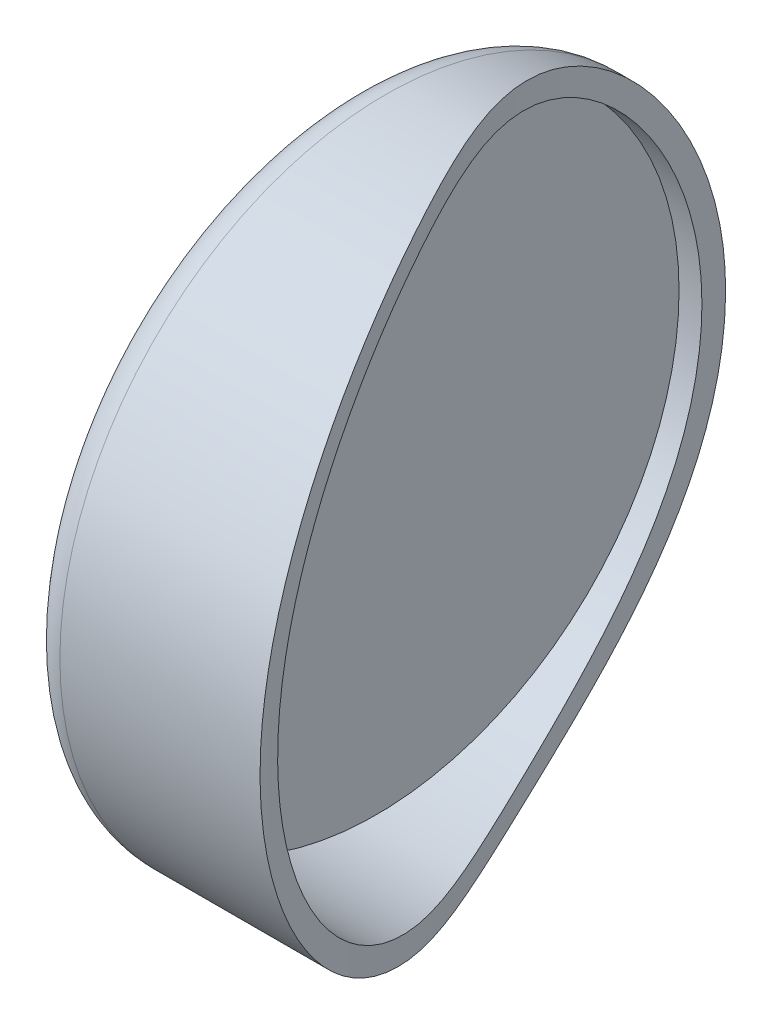
ISO-10303-21;
HEADER;
FILE_DESCRIPTION(('STEP AP214'),'2;1');
FILE_NAME('part.step','',(''),(''),'','','');
FILE_SCHEMA(('AUTOMOTIVE_DESIGN { 1 0 10303 214 1 1 1 1 }'));
ENDSEC;
DATA;
#1=APPLICATION_CONTEXT('core data for automotive mechanical design processes');
#2=APPLICATION_PROTOCOL_DEFINITION('international standard','automotive_design',2000,#1);
#3=PRODUCT_CONTEXT('',#1,'mechanical');
#4=PRODUCT('Part','Part','',(#3));
#5=PRODUCT_RELATED_PRODUCT_CATEGORY('part','',(#4));
#6=PRODUCT_DEFINITION_FORMATION('','',#4);
#7=PRODUCT_DEFINITION_CONTEXT('part definition',#1,'design');
#8=PRODUCT_DEFINITION('design','',#6,#7);
#9=PRODUCT_DEFINITION_SHAPE('','',#8);
#10=(LENGTH_UNIT() NAMED_UNIT(*) SI_UNIT(.MILLI.,.METRE.));
#11=(NAMED_UNIT(*) PLANE_ANGLE_UNIT() SI_UNIT($,.RADIAN.));
#12=(NAMED_UNIT(*) SI_UNIT($,.STERADIAN.) SOLID_ANGLE_UNIT());
#13=UNCERTAINTY_MEASURE_WITH_UNIT(LENGTH_MEASURE(1.E-05),#10,'distance_accuracy_value','');
#14=(GEOMETRIC_REPRESENTATION_CONTEXT(3) GLOBAL_UNCERTAINTY_ASSIGNED_CONTEXT((#13)) GLOBAL_UNIT_ASSIGNED_CONTEXT((#10,
#11,#12)) REPRESENTATION_CONTEXT('',''));
#15=CARTESIAN_POINT('',(0.,0.,0.));
#16=DIRECTION('',(0.,0.,1.));
#17=DIRECTION('',(1.,0.,0.));
#18=AXIS2_PLACEMENT_3D('',#15,#16,#17);
#19=CARTESIAN_POINT('',(50.,0.,0.));
#20=DIRECTION('',(-1.,0.,0.));
#21=DIRECTION('',(0.,0.,1.));
#22=AXIS2_PLACEMENT_3D('',#19,#20,#21);
#23=CYLINDRICAL_SURFACE('',#22,70.);
#24=CARTESIAN_POINT('',(7.,0.,0.));
#25=DIRECTION('',(1.,0.,0.));
#26=DIRECTION('',(0.,0.,-1.));
#27=AXIS2_PLACEMENT_3D('',#24,#25,#26);
#28=CIRCLE('',#27,70.);
#29=CARTESIAN_POINT('',(7.,0.,-70.));
#30=VERTEX_POINT('',#29);
#31=EDGE_CURVE('E52',#30,#30,#28,.T.);
#32=ORIENTED_EDGE('',*,*,#31,.T.);
#33=EDGE_LOOP('',(#32));
#34=FACE_BOUND('',#33,.T.);
#35=CARTESIAN_POINT('',(50.,0.,70.));
#36=CARTESIAN_POINT('',(50.0000018003316,1.91130000398539,69.9999962525769));
#37=CARTESIAN_POINT('',(49.9823059619208,3.82266490187084,69.9216631907981));
#38=CARTESIAN_POINT('',(49.9107786034703,7.63195740908031,69.6089486036693));
#39=CARTESIAN_POINT('',(49.8569455766294,9.52988445475555,69.3745605713471));
#40=CARTESIAN_POINT('',(49.7110853451611,13.298961887616,68.7516272956741));
#41=CARTESIAN_POINT('',(49.6190550008448,15.1701100605876,68.3630693802023));
#42=CARTESIAN_POINT('',(49.3939428916241,18.8720619893456,67.4350547678297));
#43=CARTESIAN_POINT('',(49.2608617481148,20.7028663553758,66.8956003550947));
#44=CARTESIAN_POINT('',(48.9505515883576,24.3113521581381,65.6703082779987));
#45=CARTESIAN_POINT('',(48.7733145159935,26.0890238346137,64.9844439048544));
#46=CARTESIAN_POINT('',(48.3719560001871,29.5781725991728,63.4724097122345));
#47=CARTESIAN_POINT('',(48.1478345356526,31.2896496574761,62.6462398296384));
#48=CARTESIAN_POINT('',(47.6506613438221,34.6341848102122,60.86103950687));
#49=CARTESIAN_POINT('',(47.3776144183036,36.2672505803761,59.9020221070789));
#50=CARTESIAN_POINT('',(46.7813553529707,39.4439895004782,57.8596360224635));
#51=CARTESIAN_POINT('',(46.4581432229093,40.9876626677959,56.7762673618155));
#52=CARTESIAN_POINT('',(45.7618353126724,43.9728757710367,54.4968512209325));
#53=CARTESIAN_POINT('',(45.3888303684963,45.4145945419111,53.3010100686265));
#54=CARTESIAN_POINT('',(44.5929291213869,48.190206523011,50.8053836716068));
#55=CARTESIAN_POINT('',(44.1700329584453,49.5241000357696,49.5055987185563));
#56=CARTESIAN_POINT('',(43.2753925222116,52.0767967651697,46.812923744282));
#57=CARTESIAN_POINT('',(42.8036417238308,53.2955845664718,45.4200212949936));
#58=CARTESIAN_POINT('',(41.8128483553499,55.6119088401151,42.5524623568207));
#59=CARTESIAN_POINT('',(41.2938048433208,56.7094428964819,41.0778042398379));
#60=CARTESIAN_POINT('',(40.3794236056434,58.4556011825207,38.5295906756666));
#61=CARTESIAN_POINT('',(39.995984212328,59.1374837269307,37.4743593249841));
#62=CARTESIAN_POINT('',(39.2082563656509,60.4404359608465,35.3344390659105));
#63=CARTESIAN_POINT('',(38.803967418465,61.0615042089472,34.2497494600854));
#64=CARTESIAN_POINT('',(37.9752201629652,62.2418240149578,32.0547696084488));
#65=CARTESIAN_POINT('',(37.5507617294224,62.8010751889844,30.9444792037084));
#66=CARTESIAN_POINT('',(36.6823773872359,63.8569983359353,28.7022508909051));
#67=CARTESIAN_POINT('',(36.2384546631374,64.3536804946315,27.5703165409622));
#68=CARTESIAN_POINT('',(35.3316242416914,65.2841450392752,25.2883080234928));
#69=CARTESIAN_POINT('',(34.8687168042539,65.7179282859708,24.1382341044382));
#70=CARTESIAN_POINT('',(34.1605388654334,66.3212257353159,22.402464514663));
#71=CARTESIAN_POINT('',(33.9221682900473,66.51443449884,21.8220779847266));
#72=CARTESIAN_POINT('',(33.4408441507808,66.8850746069647,20.6581641324341));
#73=CARTESIAN_POINT('',(33.1978906495045,67.062506166897,20.0746368530592));
#74=CARTESIAN_POINT('',(32.7567089219999,67.3675392623906,19.0223941749003));
#75=CARTESIAN_POINT('',(32.5592985218957,67.4979914500122,18.5541586718265));
#76=CARTESIAN_POINT('',(32.1615756327022,67.7488307492125,17.6162309447409));
#77=CARTESIAN_POINT('',(31.9612631764652,67.8692179746267,17.1465387372667));
#78=CARTESIAN_POINT('',(31.5579662400618,68.099971499391,16.2058152093342));
#79=CARTESIAN_POINT('',(31.3549816403137,68.2103373485156,15.734783829691));
#80=CARTESIAN_POINT('',(30.946662312012,68.4210833977731,14.7915140927725));
#81=CARTESIAN_POINT('',(30.7413275750215,68.5214635620455,14.319275731169));
#82=CARTESIAN_POINT('',(30.122232236501,68.8076974343487,12.9008318853234));
#83=CARTESIAN_POINT('',(29.7053893942726,68.9786394560444,11.9529183148476));
#84=CARTESIAN_POINT('',(28.8662186125377,69.2810006459276,10.0532607918036));
#85=CARTESIAN_POINT('',(28.4438906404444,69.4124195791994,9.10151681650242));
#86=CARTESIAN_POINT('',(27.595858839554,69.6361051990004,7.19289203604649));
#87=CARTESIAN_POINT('',(27.1701503602873,69.7283022098274,6.23600512200615));
#88=CARTESIAN_POINT('',(26.3191547951072,69.8732344656959,4.31913380809848));
#89=CARTESIAN_POINT('',(25.8938676849327,69.9259721325379,3.35914960195867));
#90=CARTESIAN_POINT('',(25.0467884748518,69.991875964692,1.43624233619641));
#91=CARTESIAN_POINT('',(24.6249964783283,70.0050409636096,0.47331919078682));
#92=CARTESIAN_POINT('',(23.7879949621204,69.9915150958389,-1.4553026518381));
#93=CARTESIAN_POINT('',(23.3727865723823,69.9648174607671,-2.42100179260845));
#94=CARTESIAN_POINT('',(22.5085018262151,69.8661450251981,-4.45740766110544));
#95=CARTESIAN_POINT('',(22.0605171785261,69.7896588296474,-5.52836432245546));
#96=CARTESIAN_POINT('',(21.1805109326669,69.5866117243761,-7.67221166687009));
#97=CARTESIAN_POINT('',(20.7484906137398,69.4600468112537,-8.7451024977289));
#98=CARTESIAN_POINT('',(19.9042218988581,69.1559939890128,-10.8914255270733));
#99=CARTESIAN_POINT('',(19.4919725657759,68.9785084962758,-11.964857697458));
#100=CARTESIAN_POINT('',(18.6905294533441,68.5717310470367,-14.1106404103873));
#101=CARTESIAN_POINT('',(18.3013373608329,68.3424353060558,-15.1829908681679));
#102=CARTESIAN_POINT('',(17.5498597092219,67.8319653328452,-17.3213568419703));
#103=CARTESIAN_POINT('',(17.1875038101539,67.5509339785347,-18.3873816560336));
#104=CARTESIAN_POINT('',(16.4906433722979,66.9359760726796,-20.5134027174912));
#105=CARTESIAN_POINT('',(16.1561413566166,66.6020447371957,-21.5733984106603));
#106=CARTESIAN_POINT('',(15.5165191133858,65.8810422115986,-23.6839951573259));
#107=CARTESIAN_POINT('',(15.2113949025932,65.4939782428823,-24.734597466869));
#108=CARTESIAN_POINT('',(14.6312785639093,64.6667924266737,-26.8228828704973));
#109=CARTESIAN_POINT('',(14.3562801854709,64.2266816253588,-27.8605686047764));
#110=CARTESIAN_POINT('',(13.8010099571301,63.2301833421241,-30.0598177833477));
#111=CARTESIAN_POINT('',(13.5251135270588,62.6661228327089,-31.2190213390867));
#112=CARTESIAN_POINT('',(13.011326826359,61.4710446598636,-33.5109071863992));
#113=CARTESIAN_POINT('',(12.7734340457399,60.8400314229811,-34.6435912252615));
#114=CARTESIAN_POINT('',(12.333854117487,59.5126784688247,-36.8772114946731));
#115=CARTESIAN_POINT('',(12.1321658208053,58.8163408258673,-37.9781487318627));
#116=CARTESIAN_POINT('',(11.7623832390699,57.3598177610642,-40.1441923584439));
#117=CARTESIAN_POINT('',(11.5943182763706,56.5995774240628,-41.2092668051838));
#118=CARTESIAN_POINT('',(11.2890779783303,55.018248739185,-43.2978978767897));
#119=CARTESIAN_POINT('',(11.1519033205706,54.1971590570984,-44.3214535905354));
#120=CARTESIAN_POINT('',(10.9052640321049,52.4970736852052,-46.3225793045326));
#121=CARTESIAN_POINT('',(10.7957978854337,51.6180811666486,-47.3001518181957));
#122=CARTESIAN_POINT('',(10.5638150743501,49.4563423753804,-49.5720104752358));
#123=CARTESIAN_POINT('',(10.4524672424479,48.1483157113886,-50.8435285410729));
#124=CARTESIAN_POINT('',(10.2677596510069,45.435716050429,-53.2815356800938));
#125=CARTESIAN_POINT('',(10.1943970516486,44.031150279731,-54.4480325993907));
#126=CARTESIAN_POINT('',(10.0773330183528,41.1347612746575,-56.6679766408525));
#127=CARTESIAN_POINT('',(10.0336239765413,39.6429605279277,-57.7214527010509));
#128=CARTESIAN_POINT('',(9.96826236017668,36.5812333208901,-59.7088341594736));
#129=CARTESIAN_POINT('',(9.94661092548707,35.0113028274945,-60.6427333761859));
#130=CARTESIAN_POINT('',(9.91789279828104,31.7153076487677,-62.432728815322));
#131=CARTESIAN_POINT('',(9.91168899033256,29.9854000882016,-63.2817715472802));
#132=CARTESIAN_POINT('',(9.90963057033029,26.4614692253321,-64.8343903711833));
#133=CARTESIAN_POINT('',(9.91377625696378,24.6674440740624,-65.5379622641929));
#134=CARTESIAN_POINT('',(9.92690900767121,21.0271909461663,-66.7949525017638));
#135=CARTESIAN_POINT('',(9.9358969405273,19.1809536581247,-67.3483438745592));
#136=CARTESIAN_POINT('',(9.95442410362848,15.4491474555595,-68.3010427693062));
#137=CARTESIAN_POINT('',(9.9639633366546,13.5635783426586,-68.700349513905));
#138=CARTESIAN_POINT('',(9.98069434019879,9.72605989045413,-69.3488966953937));
#139=CARTESIAN_POINT('',(9.98783266929288,7.77354781380426,-69.5948134151373));
#140=CARTESIAN_POINT('',(9.99751835051571,3.8547012137418,-69.9214359056832));
#141=CARTESIAN_POINT('',(10.0000656266398,1.88836646203667,-70.0021389413863));
#142=CARTESIAN_POINT('',(9.99993169721231,-2.04406650629275,-69.9977744782511));
#143=CARTESIAN_POINT('',(9.99725045001398,-4.01016472090822,-69.9127056589933));
#144=CARTESIAN_POINT('',(9.98732402555103,-7.92846657601206,-69.5773265396055));
#145=CARTESIAN_POINT('',(9.98007886408241,-9.88067026456663,-69.3270168113848));
#146=CARTESIAN_POINT('',(9.96731124831394,-12.7879971193687,-68.8290335349409));
#147=CARTESIAN_POINT('',(9.96273656611362,-13.7539839048279,-68.6425222345954));
#148=CARTESIAN_POINT('',(9.95334461017676,-15.6772152950928,-68.2289668116408));
#149=CARTESIAN_POINT('',(9.94852735912667,-16.6344607075866,-68.0019264745069));
#150=CARTESIAN_POINT('',(9.93910173505499,-18.5386086016579,-67.5076864516678));
#151=CARTESIAN_POINT('',(9.9344933822661,-19.4855100746676,-67.240482886752));
#152=CARTESIAN_POINT('',(9.92602756218746,-21.3671303601561,-66.6664316827342));
#153=CARTESIAN_POINT('',(9.92217002457231,-22.3018503059629,-66.3595877610451));
#154=CARTESIAN_POINT('',(9.91582738289556,-24.1577060829675,-65.7067199036378));
#155=CARTESIAN_POINT('',(9.91334253589435,-25.0788393384055,-65.3606886440135));
#156=CARTESIAN_POINT('',(9.91045318599057,-26.9056199120294,-64.6301417881728));
#157=CARTESIAN_POINT('',(9.91004848704367,-27.8112686815381,-64.2456298220675));
#158=CARTESIAN_POINT('',(9.9121083648527,-29.6056405703085,-63.4387409206909));
#159=CARTESIAN_POINT('',(9.91457321785877,-30.4943620516179,-63.0163603434433));
#160=CARTESIAN_POINT('',(9.92324431748104,-32.2531149258016,-62.1345650745391));
#161=CARTESIAN_POINT('',(9.92945020744462,-33.1231480921431,-61.6751539168176));
#162=CARTESIAN_POINT('',(9.94655729286336,-34.8431509957535,-60.7200346663467));
#163=CARTESIAN_POINT('',(9.95745906068776,-35.6931182739139,-60.2243221550278));
#164=CARTESIAN_POINT('',(9.98498969290842,-37.3712576458986,-59.1976061975909));
#165=CARTESIAN_POINT('',(10.0016180017531,-38.1994318455588,-58.6666061788674));
#166=CARTESIAN_POINT('',(10.0417133348979,-39.8326448286116,-57.5701995666731));
#167=CARTESIAN_POINT('',(10.0651810927974,-40.6376811200508,-57.0047892875077));
#168=CARTESIAN_POINT('',(10.120133531042,-42.2229606282549,-55.8407425206644));
#169=CARTESIAN_POINT('',(10.1516174150298,-43.003206299174,-55.2421093381136));
#170=CARTESIAN_POINT('',(10.2238533783861,-44.5376024616365,-54.0126699692889));
#171=CARTESIAN_POINT('',(10.2646062994534,-45.2917505761537,-53.3818608652352));
#172=CARTESIAN_POINT('',(10.3566773588878,-46.7723778991138,-52.0894444651618));
#173=CARTESIAN_POINT('',(10.4079944302186,-47.4988598932092,-51.4278402848302));
#174=CARTESIAN_POINT('',(10.5225481870651,-48.9229050475497,-50.0750820657441));
#175=CARTESIAN_POINT('',(10.585785708671,-49.6204661751205,-49.383925956873));
#176=CARTESIAN_POINT('',(10.7255442842335,-50.9852059708672,-47.9736558333663));
#177=CARTESIAN_POINT('',(10.8020643537504,-51.6523868860583,-47.2545438937479));
#178=CARTESIAN_POINT('',(10.9954453810907,-53.1545361657706,-45.5657052763155));
#179=CARTESIAN_POINT('',(11.1174855679789,-53.9783735020094,-44.5866267002481));
#180=CARTESIAN_POINT('',(11.3896072386892,-55.5694010164453,-42.5872518302571));
#181=CARTESIAN_POINT('',(11.5396884652288,-56.3365917142974,-41.5669559145789));
#182=CARTESIAN_POINT('',(11.8707271293927,-57.8119043943884,-39.4893259895876));
#183=CARTESIAN_POINT('',(12.051684225645,-58.5200270295709,-38.4319923898759));
#184=CARTESIAN_POINT('',(12.4467723318948,-59.8743953988679,-36.2858819065703));
#185=CARTESIAN_POINT('',(12.6608706085665,-60.520701180842,-35.1971369019401));
#186=CARTESIAN_POINT('',(13.1243412655142,-61.7504798330987,-32.9919992815944));
#187=CARTESIAN_POINT('',(13.3737140309426,-62.3339520171964,-31.875606364109));
#188=CARTESIAN_POINT('',(13.908989341291,-63.4367223363465,-29.6202266058435));
#189=CARTESIAN_POINT('',(14.1948888764819,-63.9560257518435,-28.481241633126));
#190=CARTESIAN_POINT('',(14.7870007668948,-64.9031297731725,-26.248299369771));
#191=CARTESIAN_POINT('',(15.0912501527951,-65.3343793700186,-25.155281493156));
#192=CARTESIAN_POINT('',(15.7322959111235,-66.1386694474769,-22.9574760107763));
#193=CARTESIAN_POINT('',(16.0690916587054,-66.5117110452442,-21.8526886313323));
#194=CARTESIAN_POINT('',(16.7739052056624,-67.1997703987994,-19.635137655809));
#195=CARTESIAN_POINT('',(17.1419213644498,-67.5147912007409,-18.5223744816561));
#196=CARTESIAN_POINT('',(17.9073654319662,-68.0876333249757,-16.2911640324334));
#197=CARTESIAN_POINT('',(18.304818180291,-68.3454055884976,-15.1727127159646));
#198=CARTESIAN_POINT('',(19.1259266504068,-68.8042352773989,-12.9337991694097));
#199=CARTESIAN_POINT('',(19.5495831537237,-69.0052910102146,-11.8133368803152));
#200=CARTESIAN_POINT('',(20.4194749878796,-69.351650935617,-9.57256070212649));
#201=CARTESIAN_POINT('',(20.8657111432286,-69.4969530906623,-8.45224681995128));
#202=CARTESIAN_POINT('',(21.8029236228948,-69.7396021865805,-6.14864083354949));
#203=CARTESIAN_POINT('',(22.2949950537794,-69.833691207904,-4.96545207312956));
#204=CARTESIAN_POINT('',(23.2943371738176,-69.9616214851268,-2.60227870028331));
#205=CARTESIAN_POINT('',(23.8016079566184,-69.9954623697438,-1.4222941076476));
#206=CARTESIAN_POINT('',(24.8256968585898,-70.0036851984277,0.933745043314098));
#207=CARTESIAN_POINT('',(25.3425152266848,-69.9780655900655,2.10979949822696));
#208=CARTESIAN_POINT('',(26.3801605579951,-69.8677959374934,4.45792566584816));
#209=CARTESIAN_POINT('',(26.9009890560284,-69.7831220541234,5.62999557799192));
#210=CARTESIAN_POINT('',(27.940791430971,-69.554823454001,7.9691566593811));
#211=CARTESIAN_POINT('',(28.4597653612317,-69.4112004470686,9.13624797203889));
#212=CARTESIAN_POINT('',(29.4905725156273,-69.0647472471468,11.4650119451505));
#213=CARTESIAN_POINT('',(30.0024049318957,-68.8619104117292,12.6266839828249));
#214=CARTESIAN_POINT('',(30.8120443784411,-68.4894331984931,14.4810771709049));
#215=CARTESIAN_POINT('',(31.1137627088467,-68.3388396558175,15.1759689701381));
#216=CARTESIAN_POINT('',(31.711812066947,-68.0159703259904,16.5630573984598));
#217=CARTESIAN_POINT('',(32.0081430357659,-67.8436943020439,17.2552539980288));
#218=CARTESIAN_POINT('',(32.5945677433735,-67.4773054021987,18.6366258499878));
#219=CARTESIAN_POINT('',(32.8846606393817,-67.2831895974916,19.32580068424));
#220=CARTESIAN_POINT('',(33.4585450360848,-66.8731231894858,20.7002375834037));
#221=CARTESIAN_POINT('',(33.7423365426429,-66.6571726065044,21.3854996519554));
#222=CARTESIAN_POINT('',(34.5841868069969,-65.9765152834804,23.4343850894553));
#223=CARTESIAN_POINT('',(35.1327529772339,-65.4789831966058,24.7911824192496));
#224=CARTESIAN_POINT('',(36.2035570538037,-64.3968867861036,27.4798267175134));
#225=CARTESIAN_POINT('',(36.7257997534032,-63.8123383845579,28.8116782004386));
#226=CARTESIAN_POINT('',(37.7431651507648,-62.5568502822304,31.4446754537666));
#227=CARTESIAN_POINT('',(38.2382883585922,-61.885912207067,32.7458218014115));
#228=CARTESIAN_POINT('',(39.2003681881327,-60.4588293643387,35.3112440322753));
#229=CARTESIAN_POINT('',(39.6673270991599,-59.7026915365417,36.5755229079128));
#230=CARTESIAN_POINT('',(40.4340311659548,-58.3503227318509,38.6819569344223));
#231=CARTESIAN_POINT('',(40.7413451358505,-57.775640745325,39.5352724520332));
#232=CARTESIAN_POINT('',(41.3415406580416,-56.5865981296316,41.2191597451639));
#233=CARTESIAN_POINT('',(41.634421383488,-55.9722352318794,42.0497302164617));
#234=CARTESIAN_POINT('',(42.2053453880156,-54.7047999337175,43.6858743300623));
#235=CARTESIAN_POINT('',(42.4833906062773,-54.0517326161155,44.4914512335377));
#236=CARTESIAN_POINT('',(43.0244145553462,-52.7076910073253,46.0757915620899));
#237=CARTESIAN_POINT('',(43.2873913392361,-52.0167118402125,46.854551517119));
#238=CARTESIAN_POINT('',(43.7978831058259,-50.5982557336537,48.3828803567587));
#239=CARTESIAN_POINT('',(44.0454030795314,-49.8707907137394,49.1324586343871));
#240=CARTESIAN_POINT('',(44.5248145729283,-48.3804951071009,50.6006092747624));
#241=CARTESIAN_POINT('',(44.7567082413308,-47.617669407132,51.3191858955154));
#242=CARTESIAN_POINT('',(45.2047475062317,-46.0578775183973,52.7235548805792));
#243=CARTESIAN_POINT('',(45.420892196653,-45.2609093695157,53.4093453578443));
#244=CARTESIAN_POINT('',(45.837289854133,-43.6344722960641,54.7461497338164));
#245=CARTESIAN_POINT('',(46.0375442650606,-42.8050063346592,55.3971667904461));
#246=CARTESIAN_POINT('',(46.4667163085624,-40.9192982182619,56.809341588844));
#247=CARTESIAN_POINT('',(46.6915267393653,-39.8550364864804,57.5610756164554));
#248=CARTESIAN_POINT('',(47.1171074831838,-37.6829216727783,59.0059224768428));
#249=CARTESIAN_POINT('',(47.3178790091129,-36.5750707939539,59.6990382667576));
#250=CARTESIAN_POINT('',(47.695704434641,-34.3192663598594,61.0237556021824));
#251=CARTESIAN_POINT('',(47.8727584905377,-33.1713130689265,61.6553575530601));
#252=CARTESIAN_POINT('',(48.2035844912864,-30.8395677737362,62.8541084885402));
#253=CARTESIAN_POINT('',(48.3573656522964,-29.6557901800674,63.4212829643678));
#254=CARTESIAN_POINT('',(48.642423673114,-27.2559184703907,64.4890661809768));
#255=CARTESIAN_POINT('',(48.7737004219448,-26.0398241950525,64.989674593496));
#256=CARTESIAN_POINT('',(49.014586615354,-23.5796416636083,65.9221606539311));
#257=CARTESIAN_POINT('',(49.1241977689297,-22.3355556241421,66.3540437224266));
#258=CARTESIAN_POINT('',(49.3576779423004,-19.3813178675982,67.2869552993888));
#259=CARTESIAN_POINT('',(49.4729947376274,-17.6611914058929,67.7588492994192));
#260=CARTESIAN_POINT('',(49.6682954562463,-14.1882899948075,68.5702031230302));
#261=CARTESIAN_POINT('',(49.7482822990257,-12.4355177555876,68.9096738891221));
#262=CARTESIAN_POINT('',(49.8752092462098,-8.90783752196351,69.4538371441957));
#263=CARTESIAN_POINT('',(49.9221470389537,-7.13292798797118,69.6585202052026));
#264=CARTESIAN_POINT('',(49.9845425967004,-3.57203166614209,69.9316078084237));
#265=CARTESIAN_POINT('',(49.999998317652,-1.78604416659201,70.0000035018381));
#266=CARTESIAN_POINT('',(50.,0.,70.));
#267=B_SPLINE_CURVE_WITH_KNOTS('',3,(#35,#36,#37,#38,#39,#40,#41,#42,#43,#44,#45,#46,#47,#48,
#49,#50,#51,#52,#53,#54,#55,#56,#57,#58,#59,#60,#61,#62,#63,#64,#65,#66,#67,#68,#69,#70,#71,#72,
#73,#74,#75,#76,#77,#78,#79,#80,#81,#82,#83,#84,#85,#86,#87,#88,#89,#90,#91,#92,#93,#94,#95,#96,
#97,#98,#99,#100,#101,#102,#103,#104,#105,#106,#107,#108,#109,#110,#111,#112,#113,#114,#115,
#116,#117,#118,#119,#120,#121,#122,#123,#124,#125,#126,#127,#128,#129,#130,#131,#132,#133,#134,
#135,#136,#137,#138,#139,#140,#141,#142,#143,#144,#145,#146,#147,#148,#149,#150,#151,#152,#153,
#154,#155,#156,#157,#158,#159,#160,#161,#162,#163,#164,#165,#166,#167,#168,#169,#170,#171,#172,
#173,#174,#175,#176,#177,#178,#179,#180,#181,#182,#183,#184,#185,#186,#187,#188,#189,#190,#191,
#192,#193,#194,#195,#196,#197,#198,#199,#200,#201,#202,#203,#204,#205,#206,#207,#208,#209,#210,
#211,#212,#213,#214,#215,#216,#217,#218,#219,#220,#221,#222,#223,#224,#225,#226,#227,#228,#229,
#230,#231,#232,#233,#234,#235,#236,#237,#238,#239,#240,#241,#242,#243,#244,#245,#246,#247,#248,
#249,#250,#251,#252,#253,#254,#255,#256,#257,#258,#259,#260,#261,#262,#263,#264,#265,#266),
.UNSPECIFIED.,.T.,.F.,(4,2,2,2,2,2,2,2,2,2,2,2,2,2,2,2,2,2,2,2,2,2,2,2,2,2,2,2,2,2,2,2,2,2,2,2,
2,2,2,2,2,2,2,2,2,2,2,2,2,2,2,2,2,2,2,2,2,2,2,2,2,2,2,2,2,2,2,2,2,2,2,2,2,2,2,2,2,2,2,2,2,2,2,2,
2,2,2,2,2,2,2,2,2,2,2,2,2,2,2,2,2,2,2,2,2,2,2,2,2,2,2,2,2,2,2,4),(0.,5.73232724515714,
11.4648935242275,17.1979310939649,22.9308818856839,28.6648794039657,34.3988795018679,
40.1323171456726,45.8657536747916,51.5888702178755,57.3119707026305,63.0358365603669,
68.7598164452608,72.6988080881981,76.637893069533,80.5770025111676,84.5154698640293,
88.4538833153499,90.4232259813796,92.3925417651457,93.9663212990974,95.5400830310857,
97.1139154317817,98.6877534842219,101.835498742536,104.983262709904,108.136595399106,
111.289734537978,114.442966613924,117.596734146493,121.085755718443,124.575056266754,
128.064191261433,131.553581202363,135.033475273509,138.513684224073,141.993420637693,
145.472433698161,149.424904764328,153.377114677401,157.329199134133,161.284715257065,
165.240318136108,169.195704552655,174.672117989316,180.148121943908,185.622720450958,
191.097601852624,196.872061354525,202.646687509746,208.422350077313,214.198041782554,
220.094892508131,225.991840854808,231.888836172532,237.785811080492,240.736611211653,
243.687135877558,246.63794570655,249.588479013646,252.5395646727,255.490372200457,
258.441463824272,261.392274149587,264.343444243895,267.294328115595,270.245528615651,
273.196436044746,276.147611545686,279.098489108083,282.04957371959,285.000439703966,
288.854293198848,292.70811133553,296.561886866122,300.411880053284,304.261915280683,
308.111633477602,311.75103926627,315.390375197161,319.029520004534,322.671771422965,
326.314131523832,329.956624723837,333.809692108517,337.662783237848,341.515974967044,
345.370723062179,349.22535935821,353.080428221954,355.397312783621,357.714222650234,
360.031443595599,362.348662384806,366.982849759148,371.616190218514,376.249443503758,
380.882319669476,384.102462941044,387.322790473619,390.542696033941,393.763016688423,
396.982292066068,400.201123866805,403.420140708764,406.638864719294,410.603258376912,
414.567451921654,418.53161934113,422.494212803661,426.4568258065,430.419126110772,
435.775509268886,441.131449719898,446.487764762267,451.844427565522),.UNSPECIFIED.);
#268=CARTESIAN_POINT('',(50.,0.,70.));
#269=VERTEX_POINT('',#268);
#270=EDGE_CURVE('E69',#269,#269,#267,.T.);
#271=ORIENTED_EDGE('',*,*,#270,.T.);
#272=EDGE_LOOP('',(#271));
#273=FACE_BOUND('',#272,.T.);
#274=ADVANCED_FACE('F39',(#34,#273),#23,.T.);
#275=CARTESIAN_POINT('',(0.,0.,0.));
#276=DIRECTION('',(1.,0.,0.));
#277=DIRECTION('',(0.,0.,-1.));
#278=AXIS2_PLACEMENT_3D('',#275,#276,#277);
#279=PLANE('',#278);
#280=CARTESIAN_POINT('',(0.,0.,0.));
#281=DIRECTION('',(1.,0.,0.));
#282=DIRECTION('',(0.,0.,-1.));
#283=AXIS2_PLACEMENT_3D('',#280,#281,#282);
#284=CIRCLE('',#283,50.);
#285=CARTESIAN_POINT('',(0.,0.,-50.));
#286=VERTEX_POINT('',#285);
#287=EDGE_CURVE('E10',#286,#286,#284,.F.);
#288=ORIENTED_EDGE('',*,*,#287,.F.);
#289=EDGE_LOOP('',(#288));
#290=FACE_BOUND('',#289,.T.);
#291=CARTESIAN_POINT('',(0.,0.,0.));
#292=DIRECTION('',(1.,0.,0.));
#293=DIRECTION('',(0.,0.,-1.));
#294=AXIS2_PLACEMENT_3D('',#291,#292,#293);
#295=CIRCLE('',#294,63.);
#296=CARTESIAN_POINT('',(0.,0.,-63.));
#297=VERTEX_POINT('',#296);
#298=EDGE_CURVE('E47',#297,#297,#295,.F.);
#299=ORIENTED_EDGE('',*,*,#298,.T.);
#300=EDGE_LOOP('',(#299));
#301=FACE_BOUND('',#300,.T.);
#302=ADVANCED_FACE('F82',(#290,#301),#279,.F.);
#303=CARTESIAN_POINT('',(10.,-82.5,-70.));
#304=CARTESIAN_POINT('',(8.73620530707256,-82.5,-29.113153139026));
#305=CARTESIAN_POINT('',(29.4581274122779,-82.5,5.56852855779937));
#306=CARTESIAN_POINT('',(46.8114824522961,-82.5,55.9434066319831));
#307=CARTESIAN_POINT('',(50.,-82.5,70.));
#308=B_SPLINE_CURVE_WITH_KNOTS('',3,(#303,#304,#305,#306,#307),.UNSPECIFIED.,.F.,.F.,(4,1,4),
(0.,0.596241341737801,1.),.UNSPECIFIED.);
#309=DIRECTION('',(0.,1.,0.));
#310=VECTOR('',#309,1.);
#311=SURFACE_OF_LINEAR_EXTRUSION('',#308,#310);
#312=CARTESIAN_POINT('',(9.91191605319725,0.,-65.));
#313=CARTESIAN_POINT('',(9.91191716700093,0.912734634114015,-65.0000020314265));
#314=CARTESIAN_POINT('',(9.91183671377505,1.82541887811777,-64.9807738992799));
#315=CARTESIAN_POINT('',(9.91155490284834,3.64924336859707,-64.9038983036968));
#316=CARTESIAN_POINT('',(9.91135353873551,4.56038353061904,-64.8462488027324));
#317=CARTESIAN_POINT('',(9.91094066739805,6.37931135454855,-64.6926375434972));
#318=CARTESIAN_POINT('',(9.91072916139129,7.28709940495946,-64.5966803752578));
#319=CARTESIAN_POINT('',(9.91048299015547,9.09791429843924,-64.3666141156314));
#320=CARTESIAN_POINT('',(9.9104483410837,10.0009406989656,-64.2325015396282));
#321=CARTESIAN_POINT('',(9.91081712467045,11.8002637481487,-63.9264134243084));
#322=CARTESIAN_POINT('',(9.91122042096286,12.6965624041912,-63.7544496842633));
#323=CARTESIAN_POINT('',(9.91280058395169,14.4812078285637,-63.3729226837012));
#324=CARTESIAN_POINT('',(9.91397752272158,15.3695538481998,-63.1633559213634));
#325=CARTESIAN_POINT('',(9.91751487850994,17.1365624613144,-62.7070234475705));
#326=CARTESIAN_POINT('',(9.9198752005664,18.015225826008,-62.4602607220614));
#327=CARTESIAN_POINT('',(9.92626382612886,19.7614574395025,-61.9299406664347));
#328=CARTESIAN_POINT('',(9.93029228561859,20.6290246429037,-61.6463798971192));
#329=CARTESIAN_POINT('',(9.94057530903783,22.3516110630802,-61.0429226288192));
#330=CARTESIAN_POINT('',(9.94683028192047,23.2066279446248,-60.7230194620272));
#331=CARTESIAN_POINT('',(9.96220114653218,24.9024405345369,-60.0474965181876));
#332=CARTESIAN_POINT('',(9.97131731067085,25.7432348807624,-59.6918733424862));
#333=CARTESIAN_POINT('',(10.0039909692131,28.2418091603261,-58.5724320263285));
#334=CARTESIAN_POINT('',(10.0328756773599,29.8762476914936,-57.755878301705));
#335=CARTESIAN_POINT('',(10.1113013396172,33.070505984937,-55.9881597909865));
#336=CARTESIAN_POINT('',(10.1608456931756,34.6303134199081,-55.0369728686513));
#337=CARTESIAN_POINT('',(10.2562995413164,36.9049803029387,-53.5150050533142));
#338=CARTESIAN_POINT('',(10.2916466917712,37.6524601985088,-52.9917393726196));
#339=CARTESIAN_POINT('',(10.3704298577076,39.1244353775719,-51.9144487469054));
#340=CARTESIAN_POINT('',(10.4138650498324,39.8489329918664,-51.3604269368637));
#341=CARTESIAN_POINT('',(10.5095845467038,41.2689864325381,-50.2263988911502));
#342=CARTESIAN_POINT('',(10.5618097152722,41.964699317567,-49.6465841926866));
#343=CARTESIAN_POINT('',(10.6763878707207,43.3307629031048,-48.4588902956353));
#344=CARTESIAN_POINT('',(10.7387398221831,44.0011161878877,-47.8510139707652));
#345=CARTESIAN_POINT('',(10.8746961523197,45.3153421495766,-46.6083437978651));
#346=CARTESIAN_POINT('',(10.9483017152063,45.9592120305871,-45.973547122105));
#347=CARTESIAN_POINT('',(11.1078748223203,47.2191205841402,-44.6785258335079));
#348=CARTESIAN_POINT('',(11.1938410886231,47.835162125104,-44.0183038544534));
#349=CARTESIAN_POINT('',(11.3792119491126,49.0380677373473,-42.6741256661012));
#350=CARTESIAN_POINT('',(11.478610714727,49.6249443135278,-41.9901798461033));
#351=CARTESIAN_POINT('',(11.6919377372299,50.7686552605942,-40.5999234626993));
#352=CARTESIAN_POINT('',(11.8058644737627,51.325492766411,-39.8936152453292));
#353=CARTESIAN_POINT('',(12.0492752366816,52.4082109604101,-38.4601894556188));
#354=CARTESIAN_POINT('',(12.1787600390826,52.9340901024808,-37.733070846664));
#355=CARTESIAN_POINT('',(12.4541844993862,53.9538928518362,-36.2598957106267));
#356=CARTESIAN_POINT('',(12.6001228931905,54.4478189094337,-35.5138406418044));
#357=CARTESIAN_POINT('',(12.9528397809887,55.5375758899214,-33.7918310862806));
#358=CARTESIAN_POINT('',(13.1651738768673,56.1229004094198,-32.8103360085777));
#359=CARTESIAN_POINT('',(13.6194917077998,57.2383515925901,-30.8231971679849));
#360=CARTESIAN_POINT('',(13.8614750304077,57.7684790239104,-29.8175537411755));
#361=CARTESIAN_POINT('',(14.3758157521201,58.7725192745743,-27.7862283881047));
#362=CARTESIAN_POINT('',(14.6481718152478,59.2464345645769,-26.7605473448544));
#363=CARTESIAN_POINT('',(15.2232657754259,60.1373350404527,-24.6934666380017));
#364=CARTESIAN_POINT('',(15.52599558632,60.5543353089408,-23.6520712203031));
#365=CARTESIAN_POINT('',(16.1612616986899,61.3313667104905,-21.5571716757608));
#366=CARTESIAN_POINT('',(16.4937989370503,61.6913960519009,-20.5036671692213));
#367=CARTESIAN_POINT('',(17.1872654842917,62.3546490314032,-18.3882175779581));
#368=CARTESIAN_POINT('',(17.5481940761765,62.6578741033788,-17.3262727069961));
#369=CARTESIAN_POINT('',(18.2919736584593,63.2048529922829,-15.2094628568582));
#370=CARTESIAN_POINT('',(18.6745216971971,63.4492560214107,-14.1546586956716));
#371=CARTESIAN_POINT('',(19.462564306738,63.8838065610739,-12.0425009473765));
#372=CARTESIAN_POINT('',(19.8680585829071,64.0739547680621,-10.9851473931695));
#373=CARTESIAN_POINT('',(20.6987329069021,64.4008430025937,-8.86998639600362));
#374=CARTESIAN_POINT('',(21.1239124554266,64.5375843839299,-7.81217896523053));
#375=CARTESIAN_POINT('',(21.9908079457432,64.7586595564594,-5.69638515917822));
#376=CARTESIAN_POINT('',(22.4325432951791,64.8429296624594,-4.63840011935573));
#377=CARTESIAN_POINT('',(23.3280636645711,64.9595745187789,-2.52469336602352));
#378=CARTESIAN_POINT('',(23.781848758687,64.9919489496325,-1.46897166648669));
#379=CARTESIAN_POINT('',(24.6973500877923,65.0054048200406,0.639506233302819));
#380=CARTESIAN_POINT('',(25.1590673076478,64.9864798437644,1.69226204613946));
#381=CARTESIAN_POINT('',(26.0277123399298,64.9032972887355,3.66155653647029));
#382=CARTESIAN_POINT('',(26.4342128709454,64.8450524973698,4.57854392273251));
#383=CARTESIAN_POINT('',(27.2472163525695,64.6897595742514,6.40928851007467));
#384=CARTESIAN_POINT('',(27.653719302342,64.5927095636602,7.32304555258912));
#385=CARTESIAN_POINT('',(28.4639916517974,64.3597741639856,9.14683424268667));
#386=CARTESIAN_POINT('',(28.8677610130133,64.2238882295631,10.0568658377745));
#387=CARTESIAN_POINT('',(29.6699704553553,63.9131368008624,11.8726306533128));
#388=CARTESIAN_POINT('',(30.0684104475121,63.7382706567022,12.778363801842));
#389=CARTESIAN_POINT('',(30.8573855013226,63.3493953255773,14.5844788020282));
#390=CARTESIAN_POINT('',(31.2479235136582,63.1354010606587,15.484862559054));
#391=CARTESIAN_POINT('',(31.8262214202736,62.784838326884,16.8308959514093));
#392=CARTESIAN_POINT('',(32.0177403553318,62.6630522641107,17.2788273531364));
#393=CARTESIAN_POINT('',(32.3980246730795,62.4095800702969,18.1730645702092));
#394=CARTESIAN_POINT('',(32.586790052227,62.2778939265228,18.6193703834633));
#395=CARTESIAN_POINT('',(32.9615305296629,62.0046173788828,19.5101114333896));
#396=CARTESIAN_POINT('',(33.147505656032,61.8630270747727,19.9545466888546));
#397=CARTESIAN_POINT('',(33.5166445831394,61.5699441850585,20.8413061147075));
#398=CARTESIAN_POINT('',(33.6998083974621,61.4184516473211,21.2836302952893));
#399=CARTESIAN_POINT('',(34.2450567994734,60.9491152582082,22.6071161574342));
#400=CARTESIAN_POINT('',(34.6028998388593,60.6164115426758,23.4847947101819));
#401=CARTESIAN_POINT('',(35.4492537159516,59.7690791241004,25.581261719512));
#402=CARTESIAN_POINT('',(35.9321492529194,59.2352549567072,26.7946088305138));
#403=CARTESIAN_POINT('',(36.8743123692521,58.0903359414237,29.1938339094065));
#404=CARTESIAN_POINT('',(37.3335778737855,57.4792343244321,30.3797094601522));
#405=CARTESIAN_POINT('',(38.227589070574,56.1807843249769,32.7186277652626));
#406=CARTESIAN_POINT('',(38.6623335951964,55.4934323162606,33.8716689548381));
#407=CARTESIAN_POINT('',(39.5063823385389,54.043928646355,36.1395198177269));
#408=CARTESIAN_POINT('',(39.9156854026088,53.2817735943026,37.2543277548118));
#409=CARTESIAN_POINT('',(40.7079239194052,51.6846225665695,39.4402331801147));
#410=CARTESIAN_POINT('',(41.0908603824497,50.8496293846898,40.5113323425285));
#411=CARTESIAN_POINT('',(41.8295234940348,49.1092178714083,42.6044234158409));
#412=CARTESIAN_POINT('',(42.1852531533919,48.2038073551091,43.6264207558812));
#413=CARTESIAN_POINT('',(42.8371760534045,46.4123383584405,45.5240193691859));
#414=CARTESIAN_POINT('',(43.1358322776012,45.5322466955325,46.4044149409347));
#415=CARTESIAN_POINT('',(43.7097504734102,43.7188863424022,48.1166686936789));
#416=CARTESIAN_POINT('',(43.9850137522954,42.7856206285917,48.9485295861328));
#417=CARTESIAN_POINT('',(44.5118529411565,40.8686959109604,50.5600395137192));
#418=CARTESIAN_POINT('',(44.7634291087571,39.8850374553986,51.3396891166834));
#419=CARTESIAN_POINT('',(45.2426238455044,37.8709210920447,52.8428953722313));
#420=CARTESIAN_POINT('',(45.4702539014154,36.8404859653826,53.5664788749996));
#421=CARTESIAN_POINT('',(45.9016910220321,34.7358046300043,54.9546463707673));
#422=CARTESIAN_POINT('',(46.1054977545427,33.6615578106547,55.6192295410286));
#423=CARTESIAN_POINT('',(46.489437342166,31.4729741086833,56.8862936641986));
#424=CARTESIAN_POINT('',(46.669571575025,30.3586395639913,57.4887782308237));
#425=CARTESIAN_POINT('',(46.9567210807137,28.4283815515703,58.4604608201796));
#426=CARTESIAN_POINT('',(47.0696204005346,27.6215085162658,58.8460108130841));
#427=CARTESIAN_POINT('',(47.2839864814434,25.9912029223169,59.5840409989135));
#428=CARTESIAN_POINT('',(47.3854526050666,25.1677694433484,59.9365193477257));
#429=CARTESIAN_POINT('',(47.5771078007386,23.5060107231203,60.607510468385));
#430=CARTESIAN_POINT('',(47.6672982143533,22.6676872670267,60.9260272802559));
#431=CARTESIAN_POINT('',(47.8366275036183,20.9775015508412,61.5284438225063));
#432=CARTESIAN_POINT('',(47.9157653312863,20.1256380154261,61.8123402699344));
#433=CARTESIAN_POINT('',(48.0631865221105,18.4101211142698,62.3447991474488));
#434=CARTESIAN_POINT('',(48.1314711376777,17.5464691213704,62.593365654098));
#435=CARTESIAN_POINT('',(48.2574237833285,15.8087900802301,63.0546613244487));
#436=CARTESIAN_POINT('',(48.3150907711338,14.9347620223788,63.2673869696618));
#437=CARTESIAN_POINT('',(48.420009485326,13.1781179917166,63.656472006182));
#438=CARTESIAN_POINT('',(48.4672622079478,12.2955028487928,63.83283487587));
#439=CARTESIAN_POINT('',(48.5515611864818,10.5231527274531,64.1488394283018));
#440=CARTESIAN_POINT('',(48.5886064843159,9.6334170887609,64.2884776639826));
#441=CARTESIAN_POINT('',(48.6520342195152,7.86585695740968,64.5283524169838));
#442=CARTESIAN_POINT('',(48.6786093896799,6.98813579805505,64.6293000943985));
#443=CARTESIAN_POINT('',(48.7222313097984,5.22899152949119,64.7953567522335));
#444=CARTESIAN_POINT('',(48.7392771844156,4.34756808768981,64.8604624402926));
#445=CARTESIAN_POINT('',(48.7639203551561,2.5827647769853,64.954677225287));
#446=CARTESIAN_POINT('',(48.7715186848232,1.69938513268115,64.9837902597491));
#447=CARTESIAN_POINT('',(48.7773094289381,-0.0679397750850054,65.0059723604378));
#448=CARTESIAN_POINT('',(48.7755009642014,-0.951885083695421,64.999038057582));
#449=CARTESIAN_POINT('',(48.7624675095424,-2.71857684471709,64.9491351086757));
#450=CARTESIAN_POINT('',(48.7512437194983,-3.6013234355345,64.9061710542156));
#451=CARTESIAN_POINT('',(48.7193229244478,-5.36423910354253,64.7843015656787));
#452=CARTESIAN_POINT('',(48.6986250343427,-6.24440793217737,64.705392773541));
#453=CARTESIAN_POINT('',(48.6476554629895,-8.00046017927143,64.5118031893592));
#454=CARTESIAN_POINT('',(48.6173846467384,-8.87634397766193,64.3971256293473));
#455=CARTESIAN_POINT('',(48.5471291437066,-10.6223547450062,64.1322513558064));
#456=CARTESIAN_POINT('',(48.5071435491787,-11.4924811681826,63.9820513230988));
#457=CARTESIAN_POINT('',(48.3723448677802,-14.092075107477,63.4785605581224));
#458=CARTESIAN_POINT('',(48.2626865306624,-15.810874755588,63.0723661845705));
#459=CARTESIAN_POINT('',(48.0022314123343,-19.2066304396585,62.1225791203108));
#460=CARTESIAN_POINT('',(47.8514347818229,-20.8835866288755,61.5789869329227));
#461=CARTESIAN_POINT('',(47.5070537128326,-24.183863331677,60.3592144406706));
#462=CARTESIAN_POINT('',(47.3134744689414,-25.8071903293389,59.6830502335857));
#463=CARTESIAN_POINT('',(46.8821156959905,-28.988965790138,58.2041045990327));
#464=CARTESIAN_POINT('',(46.6443361874839,-30.5474142834432,57.4013232304415));
#465=CARTESIAN_POINT('',(46.1236480391651,-33.5886335276171,55.6763817834586));
#466=CARTESIAN_POINT('',(45.840744194479,-35.0714122974358,54.754234391427));
#467=CARTESIAN_POINT('',(45.2293916352146,-37.9517108437056,52.7986525373481));
#468=CARTESIAN_POINT('',(44.9009430350032,-39.3492308342364,51.7652183547533));
#469=CARTESIAN_POINT('',(44.1986382044948,-42.0505255891297,49.5959164773463));
#470=CARTESIAN_POINT('',(43.824773731508,-43.3542832676708,48.4600301977974));
#471=CARTESIAN_POINT('',(43.032360349162,-45.86033497092,46.0955190445502));
#472=CARTESIAN_POINT('',(42.6138107090276,-47.0626273357023,44.8668926542893));
#473=CARTESIAN_POINT('',(41.8740040951233,-48.9922276836841,42.733123976723));
#474=CARTESIAN_POINT('',(41.5643736124027,-49.7485872633583,41.8500086116906));
#475=CARTESIAN_POINT('',(40.925439640986,-51.2097296355124,40.0488207385338));
#476=CARTESIAN_POINT('',(40.5961358789707,-51.9145117111273,39.1307477448102));
#477=CARTESIAN_POINT('',(39.918398420054,-53.2709857617214,37.2630420642191));
#478=CARTESIAN_POINT('',(39.5699649286834,-53.9226783069104,36.3134097164702));
#479=CARTESIAN_POINT('',(38.8546395086395,-55.1715881783082,34.3862438913047));
#480=CARTESIAN_POINT('',(38.4877542934544,-55.7688250983736,33.4087206169572));
#481=CARTESIAN_POINT('',(37.7359773426996,-56.9081345355336,31.4287898816674));
#482=CARTESIAN_POINT('',(37.3510855535909,-57.4502068885922,30.426382346741));
#483=CARTESIAN_POINT('',(36.5638295431338,-58.4784896417735,28.3999495188913));
#484=CARTESIAN_POINT('',(36.1614648154304,-58.9646984215141,27.3759235999233));
#485=CARTESIAN_POINT('',(35.4255009285022,-59.7851896675812,25.5251114226485));
#486=CARTESIAN_POINT('',(35.0950560937584,-60.1300120546367,24.7017179754799));
#487=CARTESIAN_POINT('',(34.4237779059194,-60.7841913076678,23.0450664738873));
#488=CARTESIAN_POINT('',(34.0829443345102,-61.0935474276868,22.2118082123848));
#489=CARTESIAN_POINT('',(33.5640942266171,-61.5308839283239,20.9558326393042));
#490=CARTESIAN_POINT('',(33.3898723256327,-61.6722169156654,20.5361469755394));
#491=CARTESIAN_POINT('',(33.0389095054205,-61.9459891008977,19.6949248626165));
#492=CARTESIAN_POINT('',(32.862168589541,-62.078428310609,19.2733884159192));
#493=CARTESIAN_POINT('',(32.5061904273703,-62.3344037955475,18.4286965042204));
#494=CARTESIAN_POINT('',(32.3269533037628,-62.4579405064857,18.0055411195229));
#495=CARTESIAN_POINT('',(31.966023606136,-62.6961263005347,17.1577858229829));
#496=CARTESIAN_POINT('',(31.7843310307082,-62.8107753785472,16.7331859103119));
#497=CARTESIAN_POINT('',(31.2353264762879,-63.1417937649868,15.4560133084302));
#498=CARTESIAN_POINT('',(30.8646468989642,-63.3448330357492,14.601392826996));
#499=CARTESIAN_POINT('',(30.1162601894073,-63.7155999502506,12.8876298804329));
#500=CARTESIAN_POINT('',(29.7385530935659,-63.8833277767937,12.0284874387374));
#501=CARTESIAN_POINT('',(28.9781405324124,-64.1836906033519,10.3062120940679));
#502=CARTESIAN_POINT('',(28.5954347405658,-64.3163232986622,9.44307893280772));
#503=CARTESIAN_POINT('',(27.8272389360357,-64.5466160338348,7.71334454633482));
#504=CARTESIAN_POINT('',(27.4417487137133,-64.6442734118182,6.84674306223039));
#505=CARTESIAN_POINT('',(26.4950221261492,-64.8410915406782,4.71601152822024));
#506=CARTESIAN_POINT('',(25.9335104532708,-64.9207772059132,3.45015293162932));
#507=CARTESIAN_POINT('',(24.8168804933703,-65.0059777221116,0.913143284996321));
#508=CARTESIAN_POINT('',(24.2617622892273,-65.0114916126599,-0.358007833362912));
#509=CARTESIAN_POINT('',(23.1652750249966,-64.9475616070317,-2.90458105214404));
#510=CARTESIAN_POINT('',(22.623907552445,-64.8781090958053,-4.18000362664356));
#511=CARTESIAN_POINT('',(21.5631511359673,-64.6631979671061,-6.73098945645886));
#512=CARTESIAN_POINT('',(21.0437250974817,-64.5178736747387,-8.00654849280367));
#513=CARTESIAN_POINT('',(20.032541323015,-64.1498378449251,-10.5573953858398));
#514=CARTESIAN_POINT('',(19.5407810079751,-63.9271335349481,-11.8326832567311));
#515=CARTESIAN_POINT('',(18.5907682970229,-63.4028748552595,-14.3793171170818));
#516=CARTESIAN_POINT('',(18.1325085476354,-63.1013378564635,-15.6506639125932));
#517=CARTESIAN_POINT('',(17.3282847563055,-62.475939050155,-17.9707086063721));
#518=CARTESIAN_POINT('',(16.9764320822955,-62.1644652083323,-19.0207184408864));
#519=CARTESIAN_POINT('',(16.3009003419053,-61.4857932094711,-21.1117321849349));
#520=CARTESIAN_POINT('',(15.9772195717822,-61.1185984259395,-22.1527366356507));
#521=CARTESIAN_POINT('',(15.359254973342,-60.328381605378,-24.2221600356856));
#522=CARTESIAN_POINT('',(15.0649697590092,-59.9053622026927,-25.2505795763814));
#523=CARTESIAN_POINT('',(14.5063076116683,-59.0038060263253,-27.2909250758807));
#524=CARTESIAN_POINT('',(14.2419267598708,-58.5252765435958,-28.3028531808788));
#525=CARTESIAN_POINT('',(13.7428297494947,-57.5133030117502,-30.3064298277531));
#526=CARTESIAN_POINT('',(13.508115220973,-56.9798559480317,-31.2980772527724));
#527=CARTESIAN_POINT('',(13.0675654157628,-55.859104941088,-33.2570844732016));
#528=CARTESIAN_POINT('',(12.8617298878797,-55.2718014663888,-34.2244444798077));
#529=CARTESIAN_POINT('',(12.5256387661335,-54.1981640614219,-35.8926485658744));
#530=CARTESIAN_POINT('',(12.3893504759893,-53.7232770552271,-36.5996809612121));
#531=CARTESIAN_POINT('',(12.1315603626337,-52.7446898136957,-37.9963781222888));
#532=CARTESIAN_POINT('',(12.0100594947816,-52.2409877198124,-38.6860417636178));
#533=CARTESIAN_POINT('',(11.7810679605606,-51.2056512392708,-40.046371434936));
#534=CARTESIAN_POINT('',(11.6735761879616,-50.6740190627724,-40.7170389616786));
#535=CARTESIAN_POINT('',(11.4717047920119,-49.5836064623425,-42.0380728083574));
#536=CARTESIAN_POINT('',(11.3773264057924,-49.0248234836772,-42.688437208393));
#537=CARTESIAN_POINT('',(11.2007428332141,-47.880929585184,-43.9676359903369));
#538=CARTESIAN_POINT('',(11.1185411880251,-47.2958110708572,-44.596464068461));
#539=CARTESIAN_POINT('',(10.9653811399691,-46.1003348517873,-45.8311861653218));
#540=CARTESIAN_POINT('',(10.8944237886084,-45.4899747933117,-46.437078035159));
#541=CARTESIAN_POINT('',(10.7628009521396,-44.245157691627,-47.6246357378472));
#542=CARTESIAN_POINT('',(10.7021346170602,-43.6107026438103,-48.2063035684498));
#543=CARTESIAN_POINT('',(10.590120756602,-42.3186669501869,-49.3444188337247));
#544=CARTESIAN_POINT('',(10.5387740924301,-41.6610841739014,-49.9008639340679));
#545=CARTESIAN_POINT('',(10.4441394378148,-40.3193680837163,-50.9911847243241));
#546=CARTESIAN_POINT('',(10.4009091771513,-39.6350835168632,-51.5248792954051));
#547=CARTESIAN_POINT('',(10.3220093363046,-38.245355026369,-52.5646845058062));
#548=CARTESIAN_POINT('',(10.2863404494363,-37.5399091691781,-53.0707926125199));
#549=CARTESIAN_POINT('',(10.221673961681,-36.1091671910882,-54.0544310806273));
#550=CARTESIAN_POINT('',(10.1926756468799,-35.3838732037295,-54.5319644961596));
#551=CARTESIAN_POINT('',(10.1404948267325,-33.9145714997252,-55.4576966622054));
#552=CARTESIAN_POINT('',(10.1173128203951,-33.1705621834226,-55.9058928933047));
#553=CARTESIAN_POINT('',(10.0552676353211,-30.9121108357172,-57.2053974899745));
#554=CARTESIAN_POINT('',(10.0239035384888,-29.3712044309953,-58.0116499256811));
#555=CARTESIAN_POINT('',(9.97537703560379,-26.2295469752543,-59.4981643162001));
#556=CARTESIAN_POINT('',(9.95821575400908,-24.6287911963558,-60.1784162920609));
#557=CARTESIAN_POINT('',(9.93634174806546,-21.7819048053476,-61.2556533880541));
#558=CARTESIAN_POINT('',(9.92959572715705,-20.5464526558084,-61.6810291256648));
#559=CARTESIAN_POINT('',(9.9196785205867,-18.0519742642284,-62.4566421883423));
#560=CARTESIAN_POINT('',(9.91650771277396,-16.7929455447714,-62.8068715683408));
#561=CARTESIAN_POINT('',(9.91233170869743,-14.2560348740935,-63.4308439328529));
#562=CARTESIAN_POINT('',(9.91132659777428,-12.9781521819177,-63.7045839028836));
#563=CARTESIAN_POINT('',(9.91038689991551,-10.4080744868328,-64.1745950208253));
#564=CARTESIAN_POINT('',(9.91045242354638,-9.11587801948351,-64.3708581654125));
#565=CARTESIAN_POINT('',(9.91087103125682,-6.52207253665597,-64.6851548769799));
#566=CARTESIAN_POINT('',(9.91122410422686,-5.22046388674472,-64.8031914659387));
#567=CARTESIAN_POINT('',(9.91174581172011,-2.61253553187057,-64.9606098044801));
#568=CARTESIAN_POINT('',(9.91191445923082,-1.30621616514412,-64.9999970928219));
#569=CARTESIAN_POINT('',(9.91191605319725,0.,-65.));
#570=B_SPLINE_CURVE_WITH_KNOTS('',3,(#312,#313,#314,#315,#316,#317,#318,#319,#320,#321,#322,
#323,#324,#325,#326,#327,#328,#329,#330,#331,#332,#333,#334,#335,#336,#337,#338,#339,#340,#341,
#342,#343,#344,#345,#346,#347,#348,#349,#350,#351,#352,#353,#354,#355,#356,#357,#358,#359,#360,
#361,#362,#363,#364,#365,#366,#367,#368,#369,#370,#371,#372,#373,#374,#375,#376,#377,#378,#379,
#380,#381,#382,#383,#384,#385,#386,#387,#388,#389,#390,#391,#392,#393,#394,#395,#396,#397,#398,
#399,#400,#401,#402,#403,#404,#405,#406,#407,#408,#409,#410,#411,#412,#413,#414,#415,#416,#417,
#418,#419,#420,#421,#422,#423,#424,#425,#426,#427,#428,#429,#430,#431,#432,#433,#434,#435,#436,
#437,#438,#439,#440,#441,#442,#443,#444,#445,#446,#447,#448,#449,#450,#451,#452,#453,#454,#455,
#456,#457,#458,#459,#460,#461,#462,#463,#464,#465,#466,#467,#468,#469,#470,#471,#472,#473,#474,
#475,#476,#477,#478,#479,#480,#481,#482,#483,#484,#485,#486,#487,#488,#489,#490,#491,#492,#493,
#494,#495,#496,#497,#498,#499,#500,#501,#502,#503,#504,#505,#506,#507,#508,#509,#510,#511,#512,
#513,#514,#515,#516,#517,#518,#519,#520,#521,#522,#523,#524,#525,#526,#527,#528,#529,#530,#531,
#532,#533,#534,#535,#536,#537,#538,#539,#540,#541,#542,#543,#544,#545,#546,#547,#548,#549,#550,
#551,#552,#553,#554,#555,#556,#557,#558,#559,#560,#561,#562,#563,#564,#565,#566,#567,#568,#569),
.UNSPECIFIED.,.T.,.F.,(4,2,2,2,2,2,2,2,2,2,2,2,2,2,2,2,2,2,2,2,2,2,2,2,2,2,2,2,2,2,2,2,2,2,2,2,
2,2,2,2,2,2,2,2,2,2,2,2,2,2,2,2,2,2,2,2,2,2,2,2,2,2,2,2,2,2,2,2,2,2,2,2,2,2,2,2,2,2,2,2,2,2,2,2,
2,2,2,2,2,2,2,2,2,2,2,2,2,2,2,2,2,2,2,2,2,2,2,2,2,2,2,2,2,2,2,2,2,2,2,2,2,2,2,2,2,2,2,2,4),(0.,
2.73791423387204,5.47597367394102,8.21370513767733,10.9516867103374,13.688815982921,
16.4262002859421,19.1633649594015,21.9007856366882,24.6387093672663,27.3768938504534,
32.8517819258624,38.3275712241873,41.066219170812,43.8045884772886,46.5252218594782,
49.2455772441378,51.9662190878083,54.6865798569588,57.4057639865277,60.1246637860197,
62.8436992568437,65.5625259714801,69.047516725161,72.5324590051715,76.0172480567743,
79.5011118305582,82.9850851449178,86.4689705031101,89.9124329839977,93.355851260208,
96.7991822446317,100.246684347801,103.694207673448,107.142162188218,110.155645079314,
113.169273892365,116.182945025265,119.196666406159,122.209240851143,123.715600035588,
125.221961157544,126.728307109466,128.23464578039,131.24731112449,135.477081513818,
139.707222665925,143.937565077871,148.168099342212,152.398471410214,156.628374648443,
160.466727520326,164.304865751482,168.142962233615,171.979209133722,175.815509520493,
179.651586534488,182.354881500298,185.058327115455,187.761450772291,190.46483055971,
193.167898162631,195.871230970604,198.574305063774,201.277632783539,203.928569953597,
206.579750591919,209.230641170517,211.881779513026,214.532580048831,217.183628280862,
219.834437036032,222.485493577629,227.787253117996,233.088993237088,238.390089981781,
243.691184261482,248.991715596588,254.292233621835,259.593715098464,264.895283288079,
268.50344151565,272.111649882741,275.71981949065,279.326685665293,282.933562564916,
286.540544059423,289.395460970599,292.250437917796,293.678010431952,295.105581048729,
296.533081749024,297.960583268155,300.820062708354,303.679527344925,306.539179716577,
309.399049682587,313.558247394107,317.717498961049,321.877228555139,326.02961851949,
330.181620745412,334.332708840649,337.78216700433,341.231416411103,344.680503107147,
348.129137295921,351.577960892347,355.026754488437,357.613656859599,360.200726272132,
362.787591272457,365.374700154997,367.962559934823,370.55066157486,373.138549350306,
375.726676144255,378.332566621188,380.938695933252,383.544546195936,386.150619950617,
391.36261864303,396.575029937636,400.492718197966,404.410820463451,408.32907712138,
412.247738427738,416.166248343033,420.084482293401),.UNSPECIFIED.);
#571=CARTESIAN_POINT('',(9.91191605319725,0.,-65.));
#572=VERTEX_POINT('',#571);
#573=EDGE_CURVE('E60',#572,#572,#570,.T.);
#574=ORIENTED_EDGE('',*,*,#573,.F.);
#575=EDGE_LOOP('',(#574));
#576=FACE_BOUND('',#575,.T.);
#577=ORIENTED_EDGE('',*,*,#270,.F.);
#578=EDGE_LOOP('',(#577));
#579=FACE_BOUND('',#578,.T.);
#580=ADVANCED_FACE('F76',(#576,#579),#311,.F.);
#581=CARTESIAN_POINT('',(5.,0.,0.));
#582=DIRECTION('',(1.,0.,0.));
#583=DIRECTION('',(0.,0.,-1.));
#584=AXIS2_PLACEMENT_3D('',#581,#582,#583);
#585=PLANE('',#584);
#586=CARTESIAN_POINT('',(5.,0.,0.));
#587=DIRECTION('',(1.,0.,0.));
#588=DIRECTION('',(0.,0.,-1.));
#589=AXIS2_PLACEMENT_3D('',#586,#587,#588);
#590=CIRCLE('',#589,65.);
#591=CARTESIAN_POINT('',(5.,0.,-65.));
#592=VERTEX_POINT('',#591);
#593=EDGE_CURVE('E57',#592,#592,#590,.T.);
#594=ORIENTED_EDGE('',*,*,#593,.T.);
#595=EDGE_LOOP('',(#594));
#596=FACE_BOUND('',#595,.T.);
#597=ADVANCED_FACE('F81',(#596),#585,.T.);
#598=CARTESIAN_POINT('',(5.,0.,0.));
#599=DIRECTION('',(1.,0.,0.));
#600=DIRECTION('',(0.,0.,-1.));
#601=AXIS2_PLACEMENT_3D('',#598,#599,#600);
#602=CYLINDRICAL_SURFACE('',#601,65.);
#603=ORIENTED_EDGE('',*,*,#573,.T.);
#604=EDGE_LOOP('',(#603));
#605=FACE_BOUND('',#604,.T.);
#606=ORIENTED_EDGE('',*,*,#593,.F.);
#607=EDGE_LOOP('',(#606));
#608=FACE_BOUND('',#607,.T.);
#609=ADVANCED_FACE('F72',(#605,#608),#602,.F.);
#610=CARTESIAN_POINT('',(7.,0.,0.));
#611=DIRECTION('',(1.,0.,0.));
#612=DIRECTION('',(0.,0.,-1.));
#613=AXIS2_PLACEMENT_3D('',#610,#611,#612);
#614=TOROIDAL_SURFACE('',#613,63.,7.);
#615=ORIENTED_EDGE('',*,*,#298,.F.);
#616=EDGE_LOOP('',(#615));
#617=FACE_BOUND('',#616,.T.);
#618=ORIENTED_EDGE('',*,*,#31,.F.);
#619=EDGE_LOOP('',(#618));
#620=FACE_BOUND('',#619,.T.);
#621=ADVANCED_FACE('F41',(#617,#620),#614,.T.);
#622=CARTESIAN_POINT('',(-2.,0.,0.));
#623=DIRECTION('',(1.,0.,0.));
#624=DIRECTION('',(0.,0.,-1.));
#625=AXIS2_PLACEMENT_3D('',#622,#623,#624);
#626=CYLINDRICAL_SURFACE('',#625,50.);
#627=CARTESIAN_POINT('',(-2.,0.,0.));
#628=DIRECTION('',(-1.,0.,0.));
#629=DIRECTION('',(0.,0.,1.));
#630=AXIS2_PLACEMENT_3D('',#627,#628,#629);
#631=CIRCLE('',#630,50.);
#632=CARTESIAN_POINT('',(-2.,0.,50.));
#633=VERTEX_POINT('',#632);
#634=EDGE_CURVE('E70',#633,#633,#631,.T.);
#635=ORIENTED_EDGE('',*,*,#634,.F.);
#636=EDGE_LOOP('',(#635));
#637=FACE_BOUND('',#636,.T.);
#638=ORIENTED_EDGE('',*,*,#287,.T.);
#639=EDGE_LOOP('',(#638));
#640=FACE_BOUND('',#639,.T.);
#641=ADVANCED_FACE('F84',(#637,#640),#626,.T.);
#642=CARTESIAN_POINT('',(-2.,0.,0.));
#643=DIRECTION('',(-1.,0.,0.));
#644=DIRECTION('',(0.,0.,1.));
#645=AXIS2_PLACEMENT_3D('',#642,#643,#644);
#646=PLANE('',#645);
#647=ORIENTED_EDGE('',*,*,#634,.T.);
#648=EDGE_LOOP('',(#647));
#649=FACE_BOUND('',#648,.T.);
#650=ADVANCED_FACE('F136',(#649),#646,.T.);
#651=CLOSED_SHELL('',(#274,#302,#580,#597,#609,#621,#641,#650));
#652=MANIFOLD_SOLID_BREP('B2',#651);
#653=ADVANCED_BREP_SHAPE_REPRESENTATION('',(#18,#652),#14);
#654=SHAPE_DEFINITION_REPRESENTATION(#9,#653);
ENDSEC;
END-ISO-10303-21;
